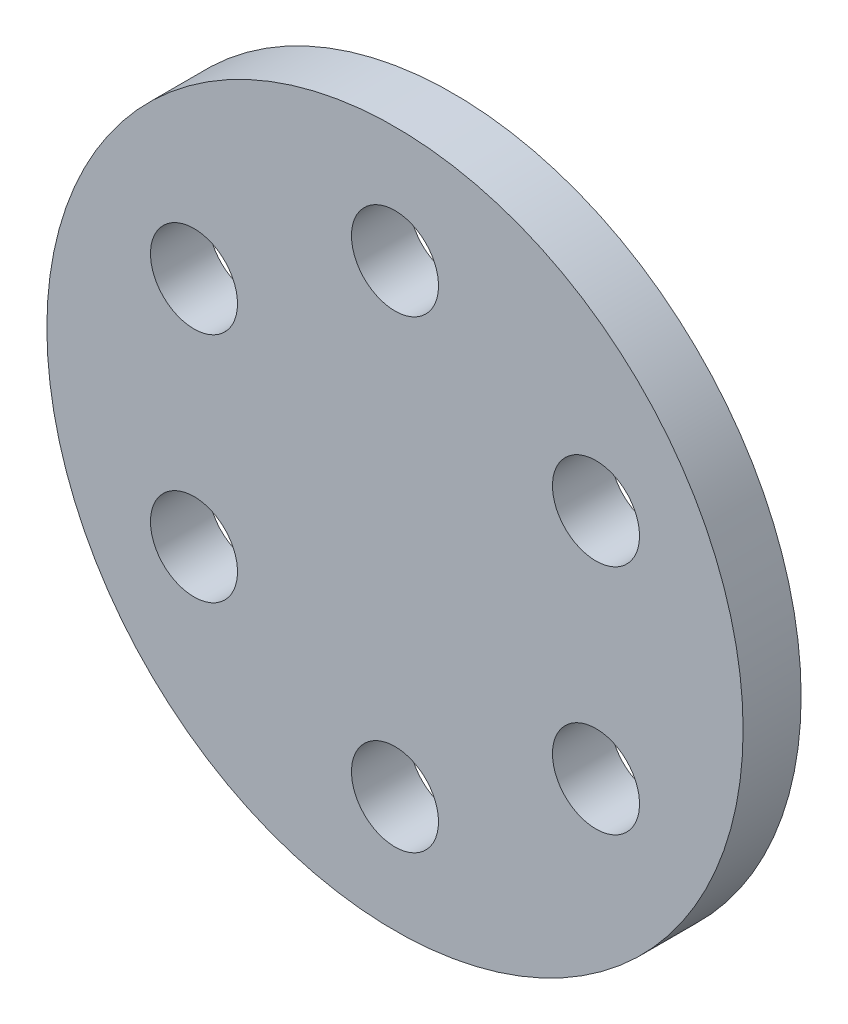
ISO-10303-21;
HEADER;
FILE_DESCRIPTION(('STEP AP214'),'2;1');
FILE_NAME('part.step','',(''),(''),'','','');
FILE_SCHEMA(('AUTOMOTIVE_DESIGN { 1 0 10303 214 1 1 1 1 }'));
ENDSEC;
DATA;
#1=APPLICATION_CONTEXT('core data for automotive mechanical design processes');
#2=APPLICATION_PROTOCOL_DEFINITION('international standard','automotive_design',2000,#1);
#3=PRODUCT_CONTEXT('',#1,'mechanical');
#4=PRODUCT('Part','Part','',(#3));
#5=PRODUCT_RELATED_PRODUCT_CATEGORY('part','',(#4));
#6=PRODUCT_DEFINITION_FORMATION('','',#4);
#7=PRODUCT_DEFINITION_CONTEXT('part definition',#1,'design');
#8=PRODUCT_DEFINITION('design','',#6,#7);
#9=PRODUCT_DEFINITION_SHAPE('','',#8);
#10=(LENGTH_UNIT() NAMED_UNIT(*) SI_UNIT(.MILLI.,.METRE.));
#11=(NAMED_UNIT(*) PLANE_ANGLE_UNIT() SI_UNIT($,.RADIAN.));
#12=(NAMED_UNIT(*) SI_UNIT($,.STERADIAN.) SOLID_ANGLE_UNIT());
#13=UNCERTAINTY_MEASURE_WITH_UNIT(LENGTH_MEASURE(1.E-05),#10,'distance_accuracy_value','');
#14=(GEOMETRIC_REPRESENTATION_CONTEXT(3) GLOBAL_UNCERTAINTY_ASSIGNED_CONTEXT((#13)) GLOBAL_UNIT_ASSIGNED_CONTEXT((#10,
#11,#12)) REPRESENTATION_CONTEXT('',''));
#15=CARTESIAN_POINT('',(0.,0.,0.));
#16=DIRECTION('',(0.,0.,1.));
#17=DIRECTION('',(1.,0.,0.));
#18=AXIS2_PLACEMENT_3D('',#15,#16,#17);
#19=CARTESIAN_POINT('',(0.,0.,10.));
#20=DIRECTION('',(0.,0.,-1.));
#21=DIRECTION('',(-1.,0.,0.));
#22=AXIS2_PLACEMENT_3D('',#19,#20,#21);
#23=CYLINDRICAL_SURFACE('',#22,60.);
#24=CARTESIAN_POINT('',(0.,0.,10.));
#25=DIRECTION('',(0.,0.,1.));
#26=DIRECTION('',(1.,0.,0.));
#27=AXIS2_PLACEMENT_3D('',#24,#25,#26);
#28=CIRCLE('',#27,60.);
#29=CARTESIAN_POINT('',(60.,0.,10.));
#30=VERTEX_POINT('',#29);
#31=EDGE_CURVE('E10',#30,#30,#28,.T.);
#32=ORIENTED_EDGE('',*,*,#31,.F.);
#33=EDGE_LOOP('',(#32));
#34=FACE_BOUND('',#33,.T.);
#35=CARTESIAN_POINT('',(0.,0.,0.));
#36=DIRECTION('',(0.,0.,1.));
#37=DIRECTION('',(1.,0.,0.));
#38=AXIS2_PLACEMENT_3D('',#35,#36,#37);
#39=CIRCLE('',#38,60.);
#40=CARTESIAN_POINT('',(60.,0.,0.));
#41=VERTEX_POINT('',#40);
#42=EDGE_CURVE('E37',#41,#41,#39,.T.);
#43=ORIENTED_EDGE('',*,*,#42,.T.);
#44=EDGE_LOOP('',(#43));
#45=FACE_BOUND('',#44,.T.);
#46=ADVANCED_FACE('F31',(#34,#45),#23,.T.);
#47=CARTESIAN_POINT('',(0.,0.,10.));
#48=DIRECTION('',(0.,0.,1.));
#49=DIRECTION('',(1.,0.,0.));
#50=AXIS2_PLACEMENT_3D('',#47,#48,#49);
#51=PLANE('',#50);
#52=CARTESIAN_POINT('',(-34.6410161513773,20.0000000000004,10.));
#53=DIRECTION('',(0.,0.,-1.));
#54=DIRECTION('',(-0.50000000000001,-0.866025403784433,0.));
#55=AXIS2_PLACEMENT_3D('',#52,#53,#54);
#56=CIRCLE('',#55,7.5);
#57=CARTESIAN_POINT('',(-38.3910161513774,13.5048094716172,10.));
#58=VERTEX_POINT('',#57);
#59=EDGE_CURVE('E74',#58,#58,#56,.T.);
#60=ORIENTED_EDGE('',*,*,#59,.T.);
#61=EDGE_LOOP('',(#60));
#62=FACE_BOUND('',#61,.T.);
#63=CARTESIAN_POINT('',(-34.6410161513777,-19.9999999999997,10.));
#64=DIRECTION('',(0.,0.,-1.));
#65=DIRECTION('',(0.499999999999992,-0.866025403784443,0.));
#66=AXIS2_PLACEMENT_3D('',#63,#64,#65);
#67=CIRCLE('',#66,7.5);
#68=CARTESIAN_POINT('',(-30.8910161513778,-26.495190528383,10.));
#69=VERTEX_POINT('',#68);
#70=EDGE_CURVE('E68',#69,#69,#67,.T.);
#71=ORIENTED_EDGE('',*,*,#70,.T.);
#72=EDGE_LOOP('',(#71));
#73=FACE_BOUND('',#72,.T.);
#74=CARTESIAN_POINT('',(-2.79318668888751E-13,-40.,10.));
#75=DIRECTION('',(0.,0.,-1.));
#76=DIRECTION('',(1.,0.,0.));
#77=AXIS2_PLACEMENT_3D('',#74,#75,#76);
#78=CIRCLE('',#77,7.5);
#79=CARTESIAN_POINT('',(7.49999999999972,-40.0000000000001,10.));
#80=VERTEX_POINT('',#79);
#81=EDGE_CURVE('E62',#80,#80,#78,.T.);
#82=ORIENTED_EDGE('',*,*,#81,.T.);
#83=EDGE_LOOP('',(#82));
#84=FACE_BOUND('',#83,.T.);
#85=CARTESIAN_POINT('',(34.6410161513775,-20.0000000000002,10.));
#86=DIRECTION('',(0.,0.,-1.));
#87=DIRECTION('',(0.500000000000004,0.866025403784436,0.));
#88=AXIS2_PLACEMENT_3D('',#85,#86,#87);
#89=CIRCLE('',#88,7.5);
#90=CARTESIAN_POINT('',(38.3910161513775,-13.5048094716169,10.));
#91=VERTEX_POINT('',#90);
#92=EDGE_CURVE('E56',#91,#91,#89,.T.);
#93=ORIENTED_EDGE('',*,*,#92,.T.);
#94=EDGE_LOOP('',(#93));
#95=FACE_BOUND('',#94,.T.);
#96=CARTESIAN_POINT('',(34.6410161513776,19.9999999999999,10.));
#97=DIRECTION('',(0.,0.,-1.));
#98=DIRECTION('',(-0.499999999999998,0.86602540378444,0.));
#99=AXIS2_PLACEMENT_3D('',#96,#97,#98);
#100=CIRCLE('',#99,7.5);
#101=CARTESIAN_POINT('',(30.8910161513776,26.4951905283832,10.));
#102=VERTEX_POINT('',#101);
#103=EDGE_CURVE('E50',#102,#102,#100,.T.);
#104=ORIENTED_EDGE('',*,*,#103,.T.);
#105=EDGE_LOOP('',(#104));
#106=FACE_BOUND('',#105,.T.);
#107=CARTESIAN_POINT('',(0.,40.,10.));
#108=DIRECTION('',(0.,0.,-1.));
#109=DIRECTION('',(-1.,0.,0.));
#110=AXIS2_PLACEMENT_3D('',#107,#108,#109);
#111=CIRCLE('',#110,7.5);
#112=CARTESIAN_POINT('',(-7.5,40.,10.));
#113=VERTEX_POINT('',#112);
#114=EDGE_CURVE('E41',#113,#113,#111,.T.);
#115=ORIENTED_EDGE('',*,*,#114,.T.);
#116=EDGE_LOOP('',(#115));
#117=FACE_BOUND('',#116,.T.);
#118=ORIENTED_EDGE('',*,*,#31,.T.);
#119=EDGE_LOOP('',(#118));
#120=FACE_BOUND('',#119,.T.);
#121=ADVANCED_FACE('F87',(#62,#73,#84,#95,#106,#117,#120),#51,.T.);
#122=CARTESIAN_POINT('',(0.,0.,0.));
#123=DIRECTION('',(0.,0.,1.));
#124=DIRECTION('',(1.,0.,0.));
#125=AXIS2_PLACEMENT_3D('',#122,#123,#124);
#126=PLANE('',#125);
#127=CARTESIAN_POINT('',(-34.6410161513773,20.0000000000004,0.));
#128=DIRECTION('',(0.,0.,-1.));
#129=DIRECTION('',(-0.50000000000001,-0.866025403784433,0.));
#130=AXIS2_PLACEMENT_3D('',#127,#128,#129);
#131=CIRCLE('',#130,7.5);
#132=CARTESIAN_POINT('',(-38.3910161513774,13.5048094716172,0.));
#133=VERTEX_POINT('',#132);
#134=EDGE_CURVE('E77',#133,#133,#131,.T.);
#135=ORIENTED_EDGE('',*,*,#134,.F.);
#136=EDGE_LOOP('',(#135));
#137=FACE_BOUND('',#136,.T.);
#138=CARTESIAN_POINT('',(-34.6410161513777,-19.9999999999997,0.));
#139=DIRECTION('',(0.,0.,-1.));
#140=DIRECTION('',(0.499999999999992,-0.866025403784443,0.));
#141=AXIS2_PLACEMENT_3D('',#138,#139,#140);
#142=CIRCLE('',#141,7.5);
#143=CARTESIAN_POINT('',(-30.8910161513778,-26.495190528383,0.));
#144=VERTEX_POINT('',#143);
#145=EDGE_CURVE('E71',#144,#144,#142,.T.);
#146=ORIENTED_EDGE('',*,*,#145,.F.);
#147=EDGE_LOOP('',(#146));
#148=FACE_BOUND('',#147,.T.);
#149=CARTESIAN_POINT('',(-2.79318668888751E-13,-40.,0.));
#150=DIRECTION('',(0.,0.,-1.));
#151=DIRECTION('',(1.,0.,0.));
#152=AXIS2_PLACEMENT_3D('',#149,#150,#151);
#153=CIRCLE('',#152,7.5);
#154=CARTESIAN_POINT('',(7.49999999999972,-40.0000000000001,0.));
#155=VERTEX_POINT('',#154);
#156=EDGE_CURVE('E65',#155,#155,#153,.T.);
#157=ORIENTED_EDGE('',*,*,#156,.F.);
#158=EDGE_LOOP('',(#157));
#159=FACE_BOUND('',#158,.T.);
#160=CARTESIAN_POINT('',(34.6410161513775,-20.0000000000002,0.));
#161=DIRECTION('',(0.,0.,-1.));
#162=DIRECTION('',(0.500000000000004,0.866025403784436,0.));
#163=AXIS2_PLACEMENT_3D('',#160,#161,#162);
#164=CIRCLE('',#163,7.5);
#165=CARTESIAN_POINT('',(38.3910161513775,-13.5048094716169,0.));
#166=VERTEX_POINT('',#165);
#167=EDGE_CURVE('E59',#166,#166,#164,.T.);
#168=ORIENTED_EDGE('',*,*,#167,.F.);
#169=EDGE_LOOP('',(#168));
#170=FACE_BOUND('',#169,.T.);
#171=CARTESIAN_POINT('',(34.6410161513776,19.9999999999999,0.));
#172=DIRECTION('',(0.,0.,-1.));
#173=DIRECTION('',(-0.499999999999998,0.86602540378444,0.));
#174=AXIS2_PLACEMENT_3D('',#171,#172,#173);
#175=CIRCLE('',#174,7.5);
#176=CARTESIAN_POINT('',(30.8910161513776,26.4951905283832,0.));
#177=VERTEX_POINT('',#176);
#178=EDGE_CURVE('E53',#177,#177,#175,.T.);
#179=ORIENTED_EDGE('',*,*,#178,.F.);
#180=EDGE_LOOP('',(#179));
#181=FACE_BOUND('',#180,.T.);
#182=CARTESIAN_POINT('',(0.,40.,0.));
#183=DIRECTION('',(0.,0.,-1.));
#184=DIRECTION('',(-1.,0.,0.));
#185=AXIS2_PLACEMENT_3D('',#182,#183,#184);
#186=CIRCLE('',#185,7.5);
#187=CARTESIAN_POINT('',(-7.5,40.,0.));
#188=VERTEX_POINT('',#187);
#189=EDGE_CURVE('E45',#188,#188,#186,.T.);
#190=ORIENTED_EDGE('',*,*,#189,.F.);
#191=EDGE_LOOP('',(#190));
#192=FACE_BOUND('',#191,.T.);
#193=ORIENTED_EDGE('',*,*,#42,.F.);
#194=EDGE_LOOP('',(#193));
#195=FACE_BOUND('',#194,.T.);
#196=ADVANCED_FACE('F83',(#137,#148,#159,#170,#181,#192,#195),#126,.F.);
#197=CARTESIAN_POINT('',(0.,40.,10.));
#198=DIRECTION('',(0.,0.,-1.));
#199=DIRECTION('',(-1.,0.,0.));
#200=AXIS2_PLACEMENT_3D('',#197,#198,#199);
#201=CYLINDRICAL_SURFACE('',#200,7.5);
#202=ORIENTED_EDGE('',*,*,#114,.F.);
#203=EDGE_LOOP('',(#202));
#204=FACE_BOUND('',#203,.T.);
#205=ORIENTED_EDGE('',*,*,#189,.T.);
#206=EDGE_LOOP('',(#205));
#207=FACE_BOUND('',#206,.T.);
#208=ADVANCED_FACE('F86',(#204,#207),#201,.F.);
#209=CARTESIAN_POINT('',(34.6410161513776,19.9999999999999,10.));
#210=DIRECTION('',(0.,0.,-1.));
#211=DIRECTION('',(-1.,0.,0.));
#212=AXIS2_PLACEMENT_3D('',#209,#210,#211);
#213=CYLINDRICAL_SURFACE('',#212,7.5);
#214=ORIENTED_EDGE('',*,*,#103,.F.);
#215=EDGE_LOOP('',(#214));
#216=FACE_BOUND('',#215,.T.);
#217=ORIENTED_EDGE('',*,*,#178,.T.);
#218=EDGE_LOOP('',(#217));
#219=FACE_BOUND('',#218,.T.);
#220=ADVANCED_FACE('F101',(#216,#219),#213,.F.);
#221=CARTESIAN_POINT('',(34.6410161513775,-20.0000000000002,10.));
#222=DIRECTION('',(0.,0.,-1.));
#223=DIRECTION('',(-1.,0.,0.));
#224=AXIS2_PLACEMENT_3D('',#221,#222,#223);
#225=CYLINDRICAL_SURFACE('',#224,7.5);
#226=ORIENTED_EDGE('',*,*,#92,.F.);
#227=EDGE_LOOP('',(#226));
#228=FACE_BOUND('',#227,.T.);
#229=ORIENTED_EDGE('',*,*,#167,.T.);
#230=EDGE_LOOP('',(#229));
#231=FACE_BOUND('',#230,.T.);
#232=ADVANCED_FACE('F107',(#228,#231),#225,.F.);
#233=CARTESIAN_POINT('',(-2.79318668888751E-13,-40.,10.));
#234=DIRECTION('',(0.,0.,-1.));
#235=DIRECTION('',(-1.,0.,0.));
#236=AXIS2_PLACEMENT_3D('',#233,#234,#235);
#237=CYLINDRICAL_SURFACE('',#236,7.5);
#238=ORIENTED_EDGE('',*,*,#81,.F.);
#239=EDGE_LOOP('',(#238));
#240=FACE_BOUND('',#239,.T.);
#241=ORIENTED_EDGE('',*,*,#156,.T.);
#242=EDGE_LOOP('',(#241));
#243=FACE_BOUND('',#242,.T.);
#244=ADVANCED_FACE('F133',(#240,#243),#237,.F.);
#245=CARTESIAN_POINT('',(-34.6410161513777,-19.9999999999997,10.));
#246=DIRECTION('',(0.,0.,-1.));
#247=DIRECTION('',(-1.,0.,0.));
#248=AXIS2_PLACEMENT_3D('',#245,#246,#247);
#249=CYLINDRICAL_SURFACE('',#248,7.5);
#250=ORIENTED_EDGE('',*,*,#70,.F.);
#251=EDGE_LOOP('',(#250));
#252=FACE_BOUND('',#251,.T.);
#253=ORIENTED_EDGE('',*,*,#145,.T.);
#254=EDGE_LOOP('',(#253));
#255=FACE_BOUND('',#254,.T.);
#256=ADVANCED_FACE('F138',(#252,#255),#249,.F.);
#257=CARTESIAN_POINT('',(-34.6410161513773,20.0000000000004,10.));
#258=DIRECTION('',(0.,0.,-1.));
#259=DIRECTION('',(-1.,0.,0.));
#260=AXIS2_PLACEMENT_3D('',#257,#258,#259);
#261=CYLINDRICAL_SURFACE('',#260,7.5);
#262=ORIENTED_EDGE('',*,*,#59,.F.);
#263=EDGE_LOOP('',(#262));
#264=FACE_BOUND('',#263,.T.);
#265=ORIENTED_EDGE('',*,*,#134,.T.);
#266=EDGE_LOOP('',(#265));
#267=FACE_BOUND('',#266,.T.);
#268=ADVANCED_FACE('F81',(#264,#267),#261,.F.);
#269=CLOSED_SHELL('',(#46,#121,#196,#208,#220,#232,#244,#256,#268));
#270=MANIFOLD_SOLID_BREP('B2',#269);
#271=ADVANCED_BREP_SHAPE_REPRESENTATION('',(#18,#270),#14);
#272=SHAPE_DEFINITION_REPRESENTATION(#9,#271);
ENDSEC;
END-ISO-10303-21;
